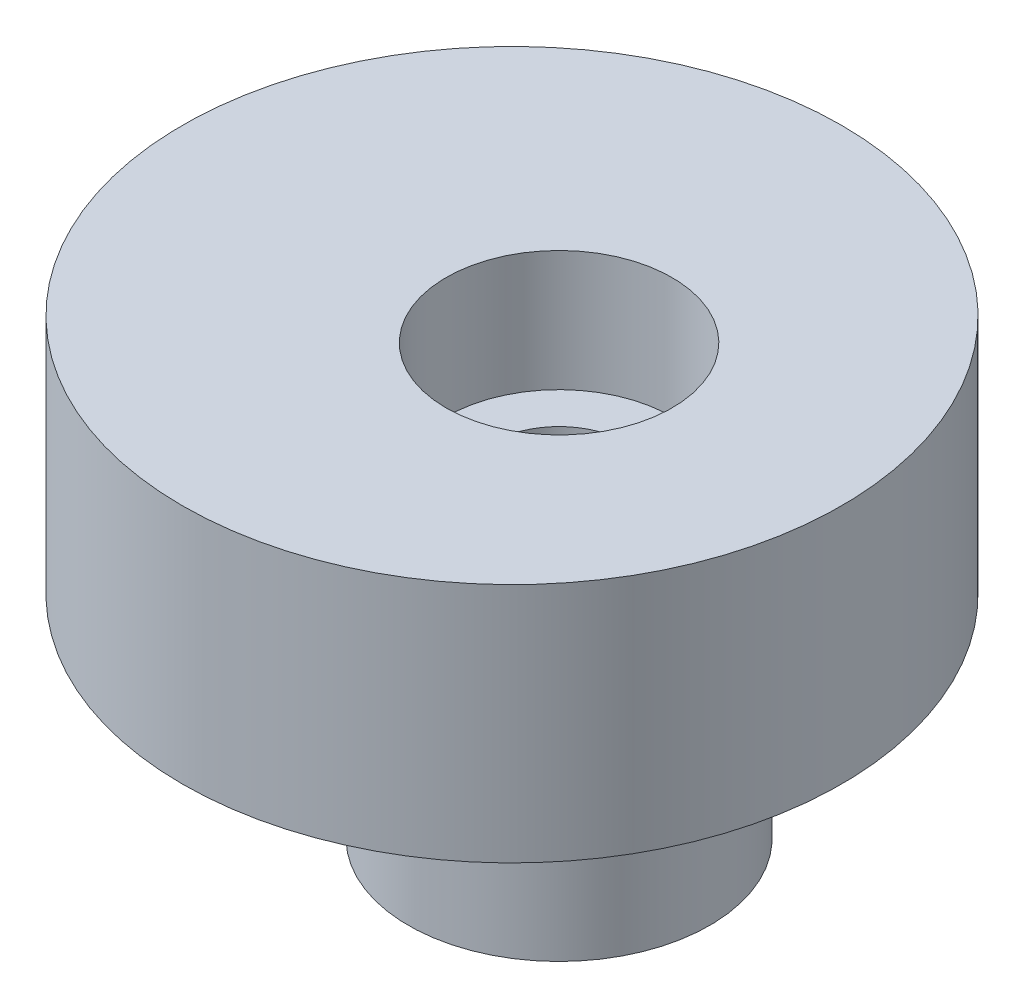
ISO-10303-21;
HEADER;
FILE_DESCRIPTION(('STEP AP214'),'2;1');
FILE_NAME('part.step','',(''),(''),'','','');
FILE_SCHEMA(('AUTOMOTIVE_DESIGN { 1 0 10303 214 1 1 1 1 }'));
ENDSEC;
DATA;
#1=APPLICATION_CONTEXT('core data for automotive mechanical design processes');
#2=APPLICATION_PROTOCOL_DEFINITION('international standard','automotive_design',2000,#1);
#3=PRODUCT_CONTEXT('',#1,'mechanical');
#4=PRODUCT('Part','Part','',(#3));
#5=PRODUCT_RELATED_PRODUCT_CATEGORY('part','',(#4));
#6=PRODUCT_DEFINITION_FORMATION('','',#4);
#7=PRODUCT_DEFINITION_CONTEXT('part definition',#1,'design');
#8=PRODUCT_DEFINITION('design','',#6,#7);
#9=PRODUCT_DEFINITION_SHAPE('','',#8);
#10=(LENGTH_UNIT() NAMED_UNIT(*) SI_UNIT(.MILLI.,.METRE.));
#11=(NAMED_UNIT(*) PLANE_ANGLE_UNIT() SI_UNIT($,.RADIAN.));
#12=(NAMED_UNIT(*) SI_UNIT($,.STERADIAN.) SOLID_ANGLE_UNIT());
#13=UNCERTAINTY_MEASURE_WITH_UNIT(LENGTH_MEASURE(1.E-05),#10,'distance_accuracy_value','');
#14=(GEOMETRIC_REPRESENTATION_CONTEXT(3) GLOBAL_UNCERTAINTY_ASSIGNED_CONTEXT((#13)) GLOBAL_UNIT_ASSIGNED_CONTEXT((#10,
#11,#12)) REPRESENTATION_CONTEXT('',''));
#15=CARTESIAN_POINT('',(0.,0.,0.));
#16=DIRECTION('',(0.,0.,1.));
#17=DIRECTION('',(1.,0.,0.));
#18=AXIS2_PLACEMENT_3D('',#15,#16,#17);
#19=CARTESIAN_POINT('',(-1.25,0.,0.));
#20=DIRECTION('',(0.,1.,0.));
#21=DIRECTION('',(0.,0.,1.));
#22=AXIS2_PLACEMENT_3D('',#19,#20,#21);
#23=PLANE('',#22);
#24=CARTESIAN_POINT('',(0.,0.,0.));
#25=DIRECTION('',(0.,-1.,0.));
#26=DIRECTION('',(0.,0.,-1.));
#27=AXIS2_PLACEMENT_3D('',#24,#25,#26);
#28=CIRCLE('',#27,5.65);
#29=CARTESIAN_POINT('',(0.,0.,-5.65));
#30=VERTEX_POINT('',#29);
#31=EDGE_CURVE('E60',#30,#30,#28,.T.);
#32=ORIENTED_EDGE('',*,*,#31,.F.);
#33=EDGE_LOOP('',(#32));
#34=FACE_BOUND('',#33,.T.);
#35=CARTESIAN_POINT('',(-1.25,0.,0.));
#36=DIRECTION('',(0.,1.,0.));
#37=DIRECTION('',(0.,0.,1.));
#38=AXIS2_PLACEMENT_3D('',#35,#36,#37);
#39=CIRCLE('',#38,8.75);
#40=CARTESIAN_POINT('',(-1.25,0.,8.75));
#41=VERTEX_POINT('',#40);
#42=EDGE_CURVE('E41',#41,#41,#39,.T.);
#43=ORIENTED_EDGE('',*,*,#42,.F.);
#44=EDGE_LOOP('',(#43));
#45=FACE_BOUND('',#44,.T.);
#46=ADVANCED_FACE('F33',(#34,#45),#23,.F.);
#47=CARTESIAN_POINT('',(0.,6.4,0.));
#48=DIRECTION('',(0.,-1.,0.));
#49=DIRECTION('',(0.,0.,-1.));
#50=AXIS2_PLACEMENT_3D('',#47,#48,#49);
#51=CYLINDRICAL_SURFACE('',#50,1.8);
#52=CARTESIAN_POINT('',(0.,3.2,0.));
#53=DIRECTION('',(0.,1.,0.));
#54=DIRECTION('',(0.,0.,1.));
#55=AXIS2_PLACEMENT_3D('',#52,#53,#54);
#56=CIRCLE('',#55,1.8);
#57=CARTESIAN_POINT('',(0.,3.2,1.8));
#58=VERTEX_POINT('',#57);
#59=EDGE_CURVE('E37',#58,#58,#56,.T.);
#60=ORIENTED_EDGE('',*,*,#59,.T.);
#61=EDGE_LOOP('',(#60));
#62=FACE_BOUND('',#61,.T.);
#63=CARTESIAN_POINT('',(0.,-5.,0.));
#64=DIRECTION('',(0.,-1.,0.));
#65=DIRECTION('',(0.,0.,-1.));
#66=AXIS2_PLACEMENT_3D('',#63,#64,#65);
#67=CIRCLE('',#66,1.8);
#68=CARTESIAN_POINT('',(0.,-5.,-1.8));
#69=VERTEX_POINT('',#68);
#70=EDGE_CURVE('E56',#69,#69,#67,.T.);
#71=ORIENTED_EDGE('',*,*,#70,.T.);
#72=EDGE_LOOP('',(#71));
#73=FACE_BOUND('',#72,.T.);
#74=ADVANCED_FACE('F85',(#62,#73),#51,.F.);
#75=CARTESIAN_POINT('',(-1.25,6.4,0.));
#76=DIRECTION('',(0.,1.,0.));
#77=DIRECTION('',(0.,0.,1.));
#78=AXIS2_PLACEMENT_3D('',#75,#76,#77);
#79=PLANE('',#78);
#80=CARTESIAN_POINT('',(0.,6.4,0.));
#81=DIRECTION('',(0.,1.,0.));
#82=DIRECTION('',(0.,0.,1.));
#83=AXIS2_PLACEMENT_3D('',#80,#81,#82);
#84=CIRCLE('',#83,3.);
#85=CARTESIAN_POINT('',(0.,6.4,3.));
#86=VERTEX_POINT('',#85);
#87=EDGE_CURVE('E47',#86,#86,#84,.T.);
#88=ORIENTED_EDGE('',*,*,#87,.F.);
#89=EDGE_LOOP('',(#88));
#90=FACE_BOUND('',#89,.T.);
#91=CARTESIAN_POINT('',(-1.25,6.4,0.));
#92=DIRECTION('',(0.,1.,0.));
#93=DIRECTION('',(0.,0.,1.));
#94=AXIS2_PLACEMENT_3D('',#91,#92,#93);
#95=CIRCLE('',#94,8.75);
#96=CARTESIAN_POINT('',(-1.25,6.4,8.75));
#97=VERTEX_POINT('',#96);
#98=EDGE_CURVE('E10',#97,#97,#95,.T.);
#99=ORIENTED_EDGE('',*,*,#98,.T.);
#100=EDGE_LOOP('',(#99));
#101=FACE_BOUND('',#100,.T.);
#102=ADVANCED_FACE('F90',(#90,#101),#79,.T.);
#103=CARTESIAN_POINT('',(-1.25,6.4,0.));
#104=DIRECTION('',(0.,-1.,0.));
#105=DIRECTION('',(0.,0.,-1.));
#106=AXIS2_PLACEMENT_3D('',#103,#104,#105);
#107=CYLINDRICAL_SURFACE('',#106,8.75);
#108=ORIENTED_EDGE('',*,*,#98,.F.);
#109=EDGE_LOOP('',(#108));
#110=FACE_BOUND('',#109,.T.);
#111=ORIENTED_EDGE('',*,*,#42,.T.);
#112=EDGE_LOOP('',(#111));
#113=FACE_BOUND('',#112,.T.);
#114=ADVANCED_FACE('F35',(#110,#113),#107,.T.);
#115=CARTESIAN_POINT('',(0.,3.2,0.));
#116=DIRECTION('',(0.,1.,0.));
#117=DIRECTION('',(0.,0.,1.));
#118=AXIS2_PLACEMENT_3D('',#115,#116,#117);
#119=CYLINDRICAL_SURFACE('',#118,3.);
#120=CARTESIAN_POINT('',(0.,3.2,0.));
#121=DIRECTION('',(0.,1.,0.));
#122=DIRECTION('',(0.,0.,1.));
#123=AXIS2_PLACEMENT_3D('',#120,#121,#122);
#124=CIRCLE('',#123,3.);
#125=CARTESIAN_POINT('',(0.,3.2,3.));
#126=VERTEX_POINT('',#125);
#127=EDGE_CURVE('E50',#126,#126,#124,.T.);
#128=ORIENTED_EDGE('',*,*,#127,.F.);
#129=EDGE_LOOP('',(#128));
#130=FACE_BOUND('',#129,.T.);
#131=ORIENTED_EDGE('',*,*,#87,.T.);
#132=EDGE_LOOP('',(#131));
#133=FACE_BOUND('',#132,.T.);
#134=ADVANCED_FACE('F89',(#130,#133),#119,.F.);
#135=CARTESIAN_POINT('',(0.,3.2,0.));
#136=DIRECTION('',(0.,1.,0.));
#137=DIRECTION('',(0.,0.,1.));
#138=AXIS2_PLACEMENT_3D('',#135,#136,#137);
#139=PLANE('',#138);
#140=ORIENTED_EDGE('',*,*,#59,.F.);
#141=EDGE_LOOP('',(#140));
#142=FACE_BOUND('',#141,.T.);
#143=ORIENTED_EDGE('',*,*,#127,.T.);
#144=EDGE_LOOP('',(#143));
#145=FACE_BOUND('',#144,.T.);
#146=ADVANCED_FACE('F96',(#142,#145),#139,.T.);
#147=CARTESIAN_POINT('',(0.,-5.,0.));
#148=DIRECTION('',(0.,-1.,0.));
#149=DIRECTION('',(0.,0.,-1.));
#150=AXIS2_PLACEMENT_3D('',#147,#148,#149);
#151=PLANE('',#150);
#152=CARTESIAN_POINT('',(0.,-5.,0.));
#153=DIRECTION('',(0.,-1.,0.));
#154=DIRECTION('',(0.,0.,-1.));
#155=AXIS2_PLACEMENT_3D('',#152,#153,#154);
#156=CIRCLE('',#155,4.);
#157=CARTESIAN_POINT('',(0.,-5.,-4.));
#158=VERTEX_POINT('',#157);
#159=EDGE_CURVE('E51',#158,#158,#156,.T.);
#160=ORIENTED_EDGE('',*,*,#159,.T.);
#161=EDGE_LOOP('',(#160));
#162=FACE_BOUND('',#161,.T.);
#163=ORIENTED_EDGE('',*,*,#70,.F.);
#164=EDGE_LOOP('',(#163));
#165=FACE_BOUND('',#164,.T.);
#166=ADVANCED_FACE('F110',(#162,#165),#151,.T.);
#167=CARTESIAN_POINT('',(0.,-5.,0.));
#168=DIRECTION('',(0.,1.,0.));
#169=DIRECTION('',(0.,0.,1.));
#170=AXIS2_PLACEMENT_3D('',#167,#168,#169);
#171=CYLINDRICAL_SURFACE('',#170,4.);
#172=ORIENTED_EDGE('',*,*,#159,.F.);
#173=EDGE_LOOP('',(#172));
#174=FACE_BOUND('',#173,.T.);
#175=CARTESIAN_POINT('',(0.,2.,0.));
#176=DIRECTION('',(0.,-1.,0.));
#177=DIRECTION('',(0.,0.,-1.));
#178=AXIS2_PLACEMENT_3D('',#175,#176,#177);
#179=CIRCLE('',#178,4.);
#180=CARTESIAN_POINT('',(0.,2.,-4.));
#181=VERTEX_POINT('',#180);
#182=EDGE_CURVE('E63',#181,#181,#179,.T.);
#183=ORIENTED_EDGE('',*,*,#182,.T.);
#184=EDGE_LOOP('',(#183));
#185=FACE_BOUND('',#184,.T.);
#186=ADVANCED_FACE('F69',(#174,#185),#171,.T.);
#187=CARTESIAN_POINT('',(0.,2.,0.));
#188=DIRECTION('',(0.,-1.,0.));
#189=DIRECTION('',(0.,0.,-1.));
#190=AXIS2_PLACEMENT_3D('',#187,#188,#189);
#191=CYLINDRICAL_SURFACE('',#190,5.65);
#192=CARTESIAN_POINT('',(0.,2.,0.));
#193=DIRECTION('',(0.,-1.,0.));
#194=DIRECTION('',(0.,0.,-1.));
#195=AXIS2_PLACEMENT_3D('',#192,#193,#194);
#196=CIRCLE('',#195,5.65);
#197=CARTESIAN_POINT('',(0.,2.,-5.65));
#198=VERTEX_POINT('',#197);
#199=EDGE_CURVE('E59',#198,#198,#196,.T.);
#200=ORIENTED_EDGE('',*,*,#199,.F.);
#201=EDGE_LOOP('',(#200));
#202=FACE_BOUND('',#201,.T.);
#203=ORIENTED_EDGE('',*,*,#31,.T.);
#204=EDGE_LOOP('',(#203));
#205=FACE_BOUND('',#204,.T.);
#206=ADVANCED_FACE('F74',(#202,#205),#191,.F.);
#207=CARTESIAN_POINT('',(0.,2.,0.));
#208=DIRECTION('',(0.,-1.,0.));
#209=DIRECTION('',(0.,0.,-1.));
#210=AXIS2_PLACEMENT_3D('',#207,#208,#209);
#211=PLANE('',#210);
#212=ORIENTED_EDGE('',*,*,#182,.F.);
#213=EDGE_LOOP('',(#212));
#214=FACE_BOUND('',#213,.T.);
#215=ORIENTED_EDGE('',*,*,#199,.T.);
#216=EDGE_LOOP('',(#215));
#217=FACE_BOUND('',#216,.T.);
#218=ADVANCED_FACE('F71',(#214,#217),#211,.T.);
#219=CLOSED_SHELL('',(#46,#74,#102,#114,#134,#146,#166,#186,#206,#218));
#220=MANIFOLD_SOLID_BREP('B2',#219);
#221=ADVANCED_BREP_SHAPE_REPRESENTATION('',(#18,#220),#14);
#222=SHAPE_DEFINITION_REPRESENTATION(#9,#221);
ENDSEC;
END-ISO-10303-21;
